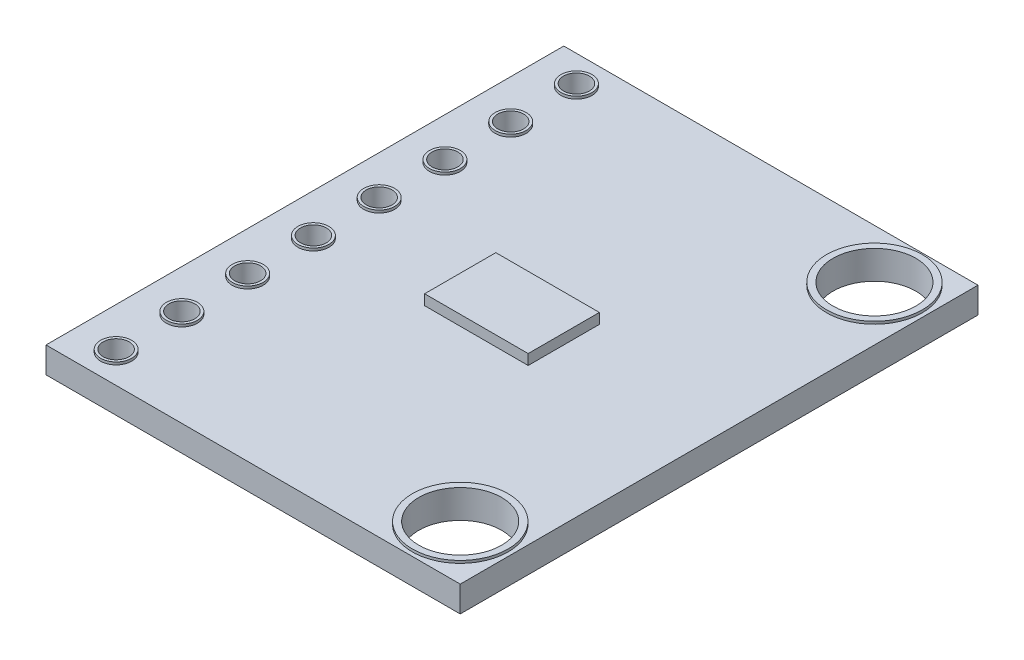
ISO-10303-21;
HEADER;
FILE_DESCRIPTION(('STEP AP214'),'2;1');
FILE_NAME('part.step','',(''),(''),'','','');
FILE_SCHEMA(('AUTOMOTIVE_DESIGN { 1 0 10303 214 1 1 1 1 }'));
ENDSEC;
DATA;
#1=APPLICATION_CONTEXT('core data for automotive mechanical design processes');
#2=APPLICATION_PROTOCOL_DEFINITION('international standard','automotive_design',2000,#1);
#3=PRODUCT_CONTEXT('',#1,'mechanical');
#4=PRODUCT('Part','Part','',(#3));
#5=PRODUCT_RELATED_PRODUCT_CATEGORY('part','',(#4));
#6=PRODUCT_DEFINITION_FORMATION('','',#4);
#7=PRODUCT_DEFINITION_CONTEXT('part definition',#1,'design');
#8=PRODUCT_DEFINITION('design','',#6,#7);
#9=PRODUCT_DEFINITION_SHAPE('','',#8);
#10=(LENGTH_UNIT() NAMED_UNIT(*) SI_UNIT(.MILLI.,.METRE.));
#11=(NAMED_UNIT(*) PLANE_ANGLE_UNIT() SI_UNIT($,.RADIAN.));
#12=(NAMED_UNIT(*) SI_UNIT($,.STERADIAN.) SOLID_ANGLE_UNIT());
#13=UNCERTAINTY_MEASURE_WITH_UNIT(LENGTH_MEASURE(1.E-05),#10,'distance_accuracy_value','');
#14=(GEOMETRIC_REPRESENTATION_CONTEXT(3) GLOBAL_UNCERTAINTY_ASSIGNED_CONTEXT((#13)) GLOBAL_UNIT_ASSIGNED_CONTEXT((#10,
#11,#12)) REPRESENTATION_CONTEXT('',''));
#15=CARTESIAN_POINT('',(0.,0.,0.));
#16=DIRECTION('',(0.,0.,1.));
#17=DIRECTION('',(1.,0.,0.));
#18=AXIS2_PLACEMENT_3D('',#15,#16,#17);
#19=CARTESIAN_POINT('',(2.,1.4,1.375));
#20=DIRECTION('',(-1.,0.,0.));
#21=DIRECTION('',(0.,0.,1.));
#22=AXIS2_PLACEMENT_3D('',#19,#20,#21);
#23=PLANE('',#22);
#24=DIRECTION('',(0.,0.,-1.));
#25=VECTOR('',#24,1.);
#26=CARTESIAN_POINT('',(2.,1.,1.375));
#27=LINE('',#26,#25);
#28=CARTESIAN_POINT('',(2.,1.,1.375));
#29=VERTEX_POINT('',#28);
#30=CARTESIAN_POINT('',(2.,1.,-1.375));
#31=VERTEX_POINT('',#30);
#32=EDGE_CURVE('E107',#29,#31,#27,.T.);
#33=ORIENTED_EDGE('',*,*,#32,.T.);
#34=DIRECTION('',(0.,-1.,0.));
#35=VECTOR('',#34,1.);
#36=CARTESIAN_POINT('',(2.,1.4,-1.375));
#37=LINE('',#36,#35);
#38=CARTESIAN_POINT('',(2.,1.4,-1.375));
#39=VERTEX_POINT('',#38);
#40=EDGE_CURVE('E12',#39,#31,#37,.T.);
#41=ORIENTED_EDGE('',*,*,#40,.F.);
#42=DIRECTION('',(0.,0.,-1.));
#43=VECTOR('',#42,1.);
#44=CARTESIAN_POINT('',(2.,1.4,1.375));
#45=LINE('',#44,#43);
#46=CARTESIAN_POINT('',(2.,1.4,1.375));
#47=VERTEX_POINT('',#46);
#48=EDGE_CURVE('E95',#47,#39,#45,.T.);
#49=ORIENTED_EDGE('',*,*,#48,.F.);
#50=DIRECTION('',(0.,-1.,0.));
#51=VECTOR('',#50,1.);
#52=CARTESIAN_POINT('',(2.,1.4,1.375));
#53=LINE('',#52,#51);
#54=EDGE_CURVE('E103',#47,#29,#53,.T.);
#55=ORIENTED_EDGE('',*,*,#54,.T.);
#56=EDGE_LOOP('',(#33,#41,#49,#55));
#57=FACE_BOUND('',#56,.T.);
#58=ADVANCED_FACE('F44',(#57),#23,.F.);
#59=CARTESIAN_POINT('',(-2.,1.4,-1.375));
#60=DIRECTION('',(0.,0.,1.));
#61=DIRECTION('',(1.,0.,0.));
#62=AXIS2_PLACEMENT_3D('',#59,#60,#61);
#63=PLANE('',#62);
#64=DIRECTION('',(-1.,0.,0.));
#65=VECTOR('',#64,1.);
#66=CARTESIAN_POINT('',(-2.,1.,-1.375));
#67=LINE('',#66,#65);
#68=CARTESIAN_POINT('',(-2.,1.,-1.375));
#69=VERTEX_POINT('',#68);
#70=EDGE_CURVE('E99',#31,#69,#67,.T.);
#71=ORIENTED_EDGE('',*,*,#70,.T.);
#72=DIRECTION('',(0.,-1.,0.));
#73=VECTOR('',#72,1.);
#74=CARTESIAN_POINT('',(-2.,1.4,-1.375));
#75=LINE('',#74,#73);
#76=CARTESIAN_POINT('',(-2.,1.4,-1.375));
#77=VERTEX_POINT('',#76);
#78=EDGE_CURVE('E52',#77,#69,#75,.T.);
#79=ORIENTED_EDGE('',*,*,#78,.F.);
#80=DIRECTION('',(-1.,0.,0.));
#81=VECTOR('',#80,1.);
#82=CARTESIAN_POINT('',(-2.,1.4,-1.375));
#83=LINE('',#82,#81);
#84=EDGE_CURVE('E90',#39,#77,#83,.T.);
#85=ORIENTED_EDGE('',*,*,#84,.F.);
#86=ORIENTED_EDGE('',*,*,#40,.T.);
#87=EDGE_LOOP('',(#71,#79,#85,#86));
#88=FACE_BOUND('',#87,.T.);
#89=ADVANCED_FACE('F98',(#88),#63,.F.);
#90=CARTESIAN_POINT('',(-2.,1.4,1.375));
#91=DIRECTION('',(1.,0.,0.));
#92=DIRECTION('',(0.,0.,-1.));
#93=AXIS2_PLACEMENT_3D('',#90,#91,#92);
#94=PLANE('',#93);
#95=DIRECTION('',(0.,0.,1.));
#96=VECTOR('',#95,1.);
#97=CARTESIAN_POINT('',(-2.,1.,1.375));
#98=LINE('',#97,#96);
#99=CARTESIAN_POINT('',(-2.,1.,1.375));
#100=VERTEX_POINT('',#99);
#101=EDGE_CURVE('E77',#69,#100,#98,.T.);
#102=ORIENTED_EDGE('',*,*,#101,.T.);
#103=DIRECTION('',(0.,-1.,0.));
#104=VECTOR('',#103,1.);
#105=CARTESIAN_POINT('',(-2.,1.4,1.375));
#106=LINE('',#105,#104);
#107=CARTESIAN_POINT('',(-2.,1.4,1.375));
#108=VERTEX_POINT('',#107);
#109=EDGE_CURVE('E100',#108,#100,#106,.T.);
#110=ORIENTED_EDGE('',*,*,#109,.F.);
#111=DIRECTION('',(0.,0.,1.));
#112=VECTOR('',#111,1.);
#113=CARTESIAN_POINT('',(-2.,1.4,1.375));
#114=LINE('',#113,#112);
#115=EDGE_CURVE('E93',#77,#108,#114,.T.);
#116=ORIENTED_EDGE('',*,*,#115,.F.);
#117=ORIENTED_EDGE('',*,*,#78,.T.);
#118=EDGE_LOOP('',(#102,#110,#116,#117));
#119=FACE_BOUND('',#118,.T.);
#120=ADVANCED_FACE('F101',(#119),#94,.F.);
#121=CARTESIAN_POINT('',(-2.,1.4,1.375));
#122=DIRECTION('',(0.,0.,-1.));
#123=DIRECTION('',(-1.,0.,0.));
#124=AXIS2_PLACEMENT_3D('',#121,#122,#123);
#125=PLANE('',#124);
#126=DIRECTION('',(1.,0.,0.));
#127=VECTOR('',#126,1.);
#128=CARTESIAN_POINT('',(-2.,1.,1.375));
#129=LINE('',#128,#127);
#130=EDGE_CURVE('E83',#100,#29,#129,.T.);
#131=ORIENTED_EDGE('',*,*,#130,.T.);
#132=ORIENTED_EDGE('',*,*,#54,.F.);
#133=DIRECTION('',(1.,0.,0.));
#134=VECTOR('',#133,1.);
#135=CARTESIAN_POINT('',(-2.,1.4,1.375));
#136=LINE('',#135,#134);
#137=EDGE_CURVE('E60',#108,#47,#136,.T.);
#138=ORIENTED_EDGE('',*,*,#137,.F.);
#139=ORIENTED_EDGE('',*,*,#109,.T.);
#140=EDGE_LOOP('',(#131,#132,#138,#139));
#141=FACE_BOUND('',#140,.T.);
#142=ADVANCED_FACE('F114',(#141),#125,.F.);
#143=CARTESIAN_POINT('',(0.,1.4,0.));
#144=DIRECTION('',(0.,-1.,0.));
#145=DIRECTION('',(0.,0.,-1.));
#146=AXIS2_PLACEMENT_3D('',#143,#144,#145);
#147=PLANE('',#146);
#148=ORIENTED_EDGE('',*,*,#48,.T.);
#149=ORIENTED_EDGE('',*,*,#84,.T.);
#150=ORIENTED_EDGE('',*,*,#115,.T.);
#151=ORIENTED_EDGE('',*,*,#137,.T.);
#152=EDGE_LOOP('',(#148,#149,#150,#151));
#153=FACE_BOUND('',#152,.T.);
#154=ADVANCED_FACE('F91',(#153),#147,.F.);
#155=CARTESIAN_POINT('',(0.,1.,0.));
#156=DIRECTION('',(0.,-1.,0.));
#157=DIRECTION('',(0.,0.,-1.));
#158=AXIS2_PLACEMENT_3D('',#155,#156,#157);
#159=PLANE('',#158);
#160=ORIENTED_EDGE('',*,*,#32,.F.);
#161=ORIENTED_EDGE('',*,*,#130,.F.);
#162=ORIENTED_EDGE('',*,*,#101,.F.);
#163=ORIENTED_EDGE('',*,*,#70,.F.);
#164=EDGE_LOOP('',(#160,#161,#162,#163));
#165=FACE_BOUND('',#164,.T.);
#166=ADVANCED_FACE('F117',(#165),#159,.T.);
#167=CLOSED_SHELL('',(#58,#89,#120,#142,#154,#166));
#168=MANIFOLD_SOLID_BREP('B2',#167);
#169=CARTESIAN_POINT('',(8.,1.,10.));
#170=DIRECTION('',(-1.,0.,0.));
#171=DIRECTION('',(0.,0.,1.));
#172=AXIS2_PLACEMENT_3D('',#169,#170,#171);
#173=PLANE('',#172);
#174=DIRECTION('',(0.,0.,-1.));
#175=VECTOR('',#174,1.);
#176=CARTESIAN_POINT('',(8.,0.,10.));
#177=LINE('',#176,#175);
#178=CARTESIAN_POINT('',(8.,0.,10.));
#179=VERTEX_POINT('',#178);
#180=CARTESIAN_POINT('',(8.,0.,-10.));
#181=VERTEX_POINT('',#180);
#182=EDGE_CURVE('E236',#179,#181,#177,.T.);
#183=ORIENTED_EDGE('',*,*,#182,.T.);
#184=DIRECTION('',(0.,-1.,0.));
#185=VECTOR('',#184,1.);
#186=CARTESIAN_POINT('',(8.,1.,-10.));
#187=LINE('',#186,#185);
#188=CARTESIAN_POINT('',(8.,1.,-10.));
#189=VERTEX_POINT('',#188);
#190=EDGE_CURVE('E227',#189,#181,#187,.T.);
#191=ORIENTED_EDGE('',*,*,#190,.F.);
#192=DIRECTION('',(0.,0.,-1.));
#193=VECTOR('',#192,1.);
#194=CARTESIAN_POINT('',(8.,1.,10.));
#195=LINE('',#194,#193);
#196=CARTESIAN_POINT('',(8.,1.,10.));
#197=VERTEX_POINT('',#196);
#198=EDGE_CURVE('E221',#197,#189,#195,.T.);
#199=ORIENTED_EDGE('',*,*,#198,.F.);
#200=DIRECTION('',(0.,-1.,0.));
#201=VECTOR('',#200,1.);
#202=CARTESIAN_POINT('',(8.,1.,10.));
#203=LINE('',#202,#201);
#204=EDGE_CURVE('E232',#197,#179,#203,.T.);
#205=ORIENTED_EDGE('',*,*,#204,.T.);
#206=EDGE_LOOP('',(#183,#191,#199,#205));
#207=FACE_BOUND('',#206,.T.);
#208=ADVANCED_FACE('F167',(#207),#173,.F.);
#209=CARTESIAN_POINT('',(-8.,1.,-10.));
#210=DIRECTION('',(0.,0.,1.));
#211=DIRECTION('',(1.,0.,0.));
#212=AXIS2_PLACEMENT_3D('',#209,#210,#211);
#213=PLANE('',#212);
#214=DIRECTION('',(-1.,0.,0.));
#215=VECTOR('',#214,1.);
#216=CARTESIAN_POINT('',(-8.,0.,-10.));
#217=LINE('',#216,#215);
#218=CARTESIAN_POINT('',(-8.,0.,-10.));
#219=VERTEX_POINT('',#218);
#220=EDGE_CURVE('E226',#181,#219,#217,.T.);
#221=ORIENTED_EDGE('',*,*,#220,.T.);
#222=DIRECTION('',(0.,-1.,0.));
#223=VECTOR('',#222,1.);
#224=CARTESIAN_POINT('',(-8.,1.,-10.));
#225=LINE('',#224,#223);
#226=CARTESIAN_POINT('',(-8.,1.,-10.));
#227=VERTEX_POINT('',#226);
#228=EDGE_CURVE('E224',#227,#219,#225,.T.);
#229=ORIENTED_EDGE('',*,*,#228,.F.);
#230=DIRECTION('',(-1.,0.,0.));
#231=VECTOR('',#230,1.);
#232=CARTESIAN_POINT('',(-8.,1.,-10.));
#233=LINE('',#232,#231);
#234=EDGE_CURVE('E216',#189,#227,#233,.T.);
#235=ORIENTED_EDGE('',*,*,#234,.F.);
#236=ORIENTED_EDGE('',*,*,#190,.T.);
#237=EDGE_LOOP('',(#221,#229,#235,#236));
#238=FACE_BOUND('',#237,.T.);
#239=ADVANCED_FACE('F225',(#238),#213,.F.);
#240=CARTESIAN_POINT('',(-8.,1.,10.));
#241=DIRECTION('',(1.,0.,0.));
#242=DIRECTION('',(0.,0.,-1.));
#243=AXIS2_PLACEMENT_3D('',#240,#241,#242);
#244=PLANE('',#243);
#245=DIRECTION('',(0.,0.,1.));
#246=VECTOR('',#245,1.);
#247=CARTESIAN_POINT('',(-8.,0.,10.));
#248=LINE('',#247,#246);
#249=CARTESIAN_POINT('',(-8.,0.,10.));
#250=VERTEX_POINT('',#249);
#251=EDGE_CURVE('E202',#219,#250,#248,.T.);
#252=ORIENTED_EDGE('',*,*,#251,.T.);
#253=DIRECTION('',(0.,-1.,0.));
#254=VECTOR('',#253,1.);
#255=CARTESIAN_POINT('',(-8.,1.,10.));
#256=LINE('',#255,#254);
#257=CARTESIAN_POINT('',(-8.,1.,10.));
#258=VERTEX_POINT('',#257);
#259=EDGE_CURVE('E228',#258,#250,#256,.T.);
#260=ORIENTED_EDGE('',*,*,#259,.F.);
#261=DIRECTION('',(0.,0.,1.));
#262=VECTOR('',#261,1.);
#263=CARTESIAN_POINT('',(-8.,1.,10.));
#264=LINE('',#263,#262);
#265=EDGE_CURVE('E219',#227,#258,#264,.T.);
#266=ORIENTED_EDGE('',*,*,#265,.F.);
#267=ORIENTED_EDGE('',*,*,#228,.T.);
#268=EDGE_LOOP('',(#252,#260,#266,#267));
#269=FACE_BOUND('',#268,.T.);
#270=ADVANCED_FACE('F230',(#269),#244,.F.);
#271=CARTESIAN_POINT('',(-8.,1.,10.));
#272=DIRECTION('',(0.,0.,-1.));
#273=DIRECTION('',(-1.,0.,0.));
#274=AXIS2_PLACEMENT_3D('',#271,#272,#273);
#275=PLANE('',#274);
#276=DIRECTION('',(1.,0.,0.));
#277=VECTOR('',#276,1.);
#278=CARTESIAN_POINT('',(-8.,0.,10.));
#279=LINE('',#278,#277);
#280=EDGE_CURVE('E208',#250,#179,#279,.T.);
#281=ORIENTED_EDGE('',*,*,#280,.T.);
#282=ORIENTED_EDGE('',*,*,#204,.F.);
#283=DIRECTION('',(1.,0.,0.));
#284=VECTOR('',#283,1.);
#285=CARTESIAN_POINT('',(-8.,1.,10.));
#286=LINE('',#285,#284);
#287=EDGE_CURVE('E185',#258,#197,#286,.T.);
#288=ORIENTED_EDGE('',*,*,#287,.F.);
#289=ORIENTED_EDGE('',*,*,#259,.T.);
#290=EDGE_LOOP('',(#281,#282,#288,#289));
#291=FACE_BOUND('',#290,.T.);
#292=ADVANCED_FACE('F377',(#291),#275,.F.);
#293=CARTESIAN_POINT('',(0.,1.,0.));
#294=DIRECTION('',(0.,-1.,0.));
#295=DIRECTION('',(0.,0.,-1.));
#296=AXIS2_PLACEMENT_3D('',#293,#294,#295);
#297=PLANE('',#296);
#298=CARTESIAN_POINT('',(6.,1.,-8.));
#299=DIRECTION('',(0.,-1.,0.));
#300=DIRECTION('',(0.,0.,-1.));
#301=AXIS2_PLACEMENT_3D('',#298,#299,#300);
#302=CIRCLE('',#301,1.85);
#303=CARTESIAN_POINT('',(6.,1.,-9.85));
#304=VERTEX_POINT('',#303);
#305=EDGE_CURVE('E42',#304,#304,#302,.F.);
#306=ORIENTED_EDGE('',*,*,#305,.F.);
#307=EDGE_LOOP('',(#306));
#308=FACE_BOUND('',#307,.T.);
#309=CARTESIAN_POINT('',(6.,1.,8.));
#310=DIRECTION('',(0.,-1.,0.));
#311=DIRECTION('',(0.,0.,-1.));
#312=AXIS2_PLACEMENT_3D('',#309,#310,#311);
#313=CIRCLE('',#312,1.85);
#314=CARTESIAN_POINT('',(6.,1.,6.15));
#315=VERTEX_POINT('',#314);
#316=EDGE_CURVE('E176',#315,#315,#313,.F.);
#317=ORIENTED_EDGE('',*,*,#316,.F.);
#318=EDGE_LOOP('',(#317));
#319=FACE_BOUND('',#318,.T.);
#320=CARTESIAN_POINT('',(-6.40078584342518,1.,-8.89000000000001));
#321=DIRECTION('',(0.,-1.,0.));
#322=DIRECTION('',(0.,0.,-1.));
#323=AXIS2_PLACEMENT_3D('',#320,#321,#322);
#324=CIRCLE('',#323,0.6);
#325=CARTESIAN_POINT('',(-6.40078584342518,1.,-9.49000000000001));
#326=VERTEX_POINT('',#325);
#327=EDGE_CURVE('E267',#326,#326,#324,.F.);
#328=ORIENTED_EDGE('',*,*,#327,.F.);
#329=EDGE_LOOP('',(#328));
#330=FACE_BOUND('',#329,.T.);
#331=CARTESIAN_POINT('',(-6.40078584342518,1.,-6.35));
#332=DIRECTION('',(0.,-1.,0.));
#333=DIRECTION('',(0.,0.,-1.));
#334=AXIS2_PLACEMENT_3D('',#331,#332,#333);
#335=CIRCLE('',#334,0.6);
#336=CARTESIAN_POINT('',(-6.40078584342518,1.,-6.95));
#337=VERTEX_POINT('',#336);
#338=EDGE_CURVE('E264',#337,#337,#335,.F.);
#339=ORIENTED_EDGE('',*,*,#338,.F.);
#340=EDGE_LOOP('',(#339));
#341=FACE_BOUND('',#340,.T.);
#342=CARTESIAN_POINT('',(-6.40078584342518,1.,-3.81));
#343=DIRECTION('',(0.,-1.,0.));
#344=DIRECTION('',(0.,0.,-1.));
#345=AXIS2_PLACEMENT_3D('',#342,#343,#344);
#346=CIRCLE('',#345,0.6);
#347=CARTESIAN_POINT('',(-6.40078584342518,1.,-4.41));
#348=VERTEX_POINT('',#347);
#349=EDGE_CURVE('E261',#348,#348,#346,.F.);
#350=ORIENTED_EDGE('',*,*,#349,.F.);
#351=EDGE_LOOP('',(#350));
#352=FACE_BOUND('',#351,.T.);
#353=CARTESIAN_POINT('',(-6.40078584342518,1.,-1.27));
#354=DIRECTION('',(0.,-1.,0.));
#355=DIRECTION('',(0.,0.,-1.));
#356=AXIS2_PLACEMENT_3D('',#353,#354,#355);
#357=CIRCLE('',#356,0.6);
#358=CARTESIAN_POINT('',(-6.40078584342518,1.,-1.87));
#359=VERTEX_POINT('',#358);
#360=EDGE_CURVE('E258',#359,#359,#357,.F.);
#361=ORIENTED_EDGE('',*,*,#360,.F.);
#362=EDGE_LOOP('',(#361));
#363=FACE_BOUND('',#362,.T.);
#364=CARTESIAN_POINT('',(-6.40078584342518,1.,8.89));
#365=DIRECTION('',(0.,-1.,0.));
#366=DIRECTION('',(0.,0.,-1.));
#367=AXIS2_PLACEMENT_3D('',#364,#365,#366);
#368=CIRCLE('',#367,0.6);
#369=CARTESIAN_POINT('',(-6.40078584342518,1.,8.29));
#370=VERTEX_POINT('',#369);
#371=EDGE_CURVE('E255',#370,#370,#368,.F.);
#372=ORIENTED_EDGE('',*,*,#371,.F.);
#373=EDGE_LOOP('',(#372));
#374=FACE_BOUND('',#373,.T.);
#375=CARTESIAN_POINT('',(-6.40078584342518,1.,1.27));
#376=DIRECTION('',(0.,-1.,0.));
#377=DIRECTION('',(0.,0.,-1.));
#378=AXIS2_PLACEMENT_3D('',#375,#376,#377);
#379=CIRCLE('',#378,0.6);
#380=CARTESIAN_POINT('',(-6.40078584342518,1.,0.669999999999995));
#381=VERTEX_POINT('',#380);
#382=EDGE_CURVE('E252',#381,#381,#379,.F.);
#383=ORIENTED_EDGE('',*,*,#382,.F.);
#384=EDGE_LOOP('',(#383));
#385=FACE_BOUND('',#384,.T.);
#386=CARTESIAN_POINT('',(-6.40078584342518,1.,3.81));
#387=DIRECTION('',(0.,-1.,0.));
#388=DIRECTION('',(0.,0.,-1.));
#389=AXIS2_PLACEMENT_3D('',#386,#387,#388);
#390=CIRCLE('',#389,0.6);
#391=CARTESIAN_POINT('',(-6.40078584342518,1.,3.21));
#392=VERTEX_POINT('',#391);
#393=EDGE_CURVE('E249',#392,#392,#390,.F.);
#394=ORIENTED_EDGE('',*,*,#393,.F.);
#395=EDGE_LOOP('',(#394));
#396=FACE_BOUND('',#395,.T.);
#397=CARTESIAN_POINT('',(-6.40078584342518,1.,6.35));
#398=DIRECTION('',(0.,-1.,0.));
#399=DIRECTION('',(0.,0.,-1.));
#400=AXIS2_PLACEMENT_3D('',#397,#398,#399);
#401=CIRCLE('',#400,0.6);
#402=CARTESIAN_POINT('',(-6.40078584342518,1.,5.75));
#403=VERTEX_POINT('',#402);
#404=EDGE_CURVE('E246',#403,#403,#401,.F.);
#405=ORIENTED_EDGE('',*,*,#404,.F.);
#406=EDGE_LOOP('',(#405));
#407=FACE_BOUND('',#406,.T.);
#408=ORIENTED_EDGE('',*,*,#198,.T.);
#409=ORIENTED_EDGE('',*,*,#234,.T.);
#410=ORIENTED_EDGE('',*,*,#265,.T.);
#411=ORIENTED_EDGE('',*,*,#287,.T.);
#412=EDGE_LOOP('',(#408,#409,#410,#411));
#413=FACE_BOUND('',#412,.T.);
#414=ADVANCED_FACE('F217',(#308,#319,#330,#341,#352,#363,#374,#385,#396,#407,#413),#297,.F.);
#415=CARTESIAN_POINT('',(0.,0.,0.));
#416=DIRECTION('',(0.,-1.,0.));
#417=DIRECTION('',(0.,0.,-1.));
#418=AXIS2_PLACEMENT_3D('',#415,#416,#417);
#419=PLANE('',#418);
#420=CARTESIAN_POINT('',(6.,0.,-8.));
#421=DIRECTION('',(0.,-1.,0.));
#422=DIRECTION('',(0.,0.,-1.));
#423=AXIS2_PLACEMENT_3D('',#420,#421,#422);
#424=CIRCLE('',#423,1.6);
#425=CARTESIAN_POINT('',(6.,0.,-9.6));
#426=VERTEX_POINT('',#425);
#427=EDGE_CURVE('E170',#426,#426,#424,.T.);
#428=ORIENTED_EDGE('',*,*,#427,.F.);
#429=EDGE_LOOP('',(#428));
#430=FACE_BOUND('',#429,.T.);
#431=CARTESIAN_POINT('',(6.,0.,8.));
#432=DIRECTION('',(0.,-1.,0.));
#433=DIRECTION('',(0.,0.,-1.));
#434=AXIS2_PLACEMENT_3D('',#431,#432,#433);
#435=CIRCLE('',#434,1.6);
#436=CARTESIAN_POINT('',(6.,0.,6.4));
#437=VERTEX_POINT('',#436);
#438=EDGE_CURVE('E297',#437,#437,#435,.T.);
#439=ORIENTED_EDGE('',*,*,#438,.F.);
#440=EDGE_LOOP('',(#439));
#441=FACE_BOUND('',#440,.T.);
#442=CARTESIAN_POINT('',(-6.40078584342518,0.,8.89));
#443=DIRECTION('',(0.,-1.,0.));
#444=DIRECTION('',(0.,0.,-1.));
#445=AXIS2_PLACEMENT_3D('',#442,#443,#444);
#446=CIRCLE('',#445,0.500000000000001);
#447=CARTESIAN_POINT('',(-6.40078584342518,0.,8.39));
#448=VERTEX_POINT('',#447);
#449=EDGE_CURVE('E292',#448,#448,#446,.T.);
#450=ORIENTED_EDGE('',*,*,#449,.F.);
#451=EDGE_LOOP('',(#450));
#452=FACE_BOUND('',#451,.T.);
#453=CARTESIAN_POINT('',(-6.40078584342518,0.,6.35));
#454=DIRECTION('',(0.,-1.,0.));
#455=DIRECTION('',(0.,0.,-1.));
#456=AXIS2_PLACEMENT_3D('',#453,#454,#455);
#457=CIRCLE('',#456,0.5);
#458=CARTESIAN_POINT('',(-6.40078584342518,0.,5.85));
#459=VERTEX_POINT('',#458);
#460=EDGE_CURVE('E289',#459,#459,#457,.T.);
#461=ORIENTED_EDGE('',*,*,#460,.F.);
#462=EDGE_LOOP('',(#461));
#463=FACE_BOUND('',#462,.T.);
#464=CARTESIAN_POINT('',(-6.40078584342518,0.,3.81));
#465=DIRECTION('',(0.,-1.,0.));
#466=DIRECTION('',(0.,0.,-1.));
#467=AXIS2_PLACEMENT_3D('',#464,#465,#466);
#468=CIRCLE('',#467,0.500000000000002);
#469=CARTESIAN_POINT('',(-6.40078584342518,0.,3.30999999999999));
#470=VERTEX_POINT('',#469);
#471=EDGE_CURVE('E286',#470,#470,#468,.T.);
#472=ORIENTED_EDGE('',*,*,#471,.F.);
#473=EDGE_LOOP('',(#472));
#474=FACE_BOUND('',#473,.T.);
#475=CARTESIAN_POINT('',(-6.40078584342518,0.,1.27));
#476=DIRECTION('',(0.,-1.,0.));
#477=DIRECTION('',(0.,0.,-1.));
#478=AXIS2_PLACEMENT_3D('',#475,#476,#477);
#479=CIRCLE('',#478,0.500000000000002);
#480=CARTESIAN_POINT('',(-6.40078584342518,0.,0.769999999999994));
#481=VERTEX_POINT('',#480);
#482=EDGE_CURVE('E283',#481,#481,#479,.T.);
#483=ORIENTED_EDGE('',*,*,#482,.F.);
#484=EDGE_LOOP('',(#483));
#485=FACE_BOUND('',#484,.T.);
#486=CARTESIAN_POINT('',(-6.40078584342518,0.,-1.27));
#487=DIRECTION('',(0.,-1.,0.));
#488=DIRECTION('',(0.,0.,-1.));
#489=AXIS2_PLACEMENT_3D('',#486,#487,#488);
#490=CIRCLE('',#489,0.500000000000002);
#491=CARTESIAN_POINT('',(-6.40078584342518,0.,-1.77000000000001));
#492=VERTEX_POINT('',#491);
#493=EDGE_CURVE('E280',#492,#492,#490,.T.);
#494=ORIENTED_EDGE('',*,*,#493,.F.);
#495=EDGE_LOOP('',(#494));
#496=FACE_BOUND('',#495,.T.);
#497=CARTESIAN_POINT('',(-6.40078584342518,0.,-3.81));
#498=DIRECTION('',(0.,-1.,0.));
#499=DIRECTION('',(0.,0.,-1.));
#500=AXIS2_PLACEMENT_3D('',#497,#498,#499);
#501=CIRCLE('',#500,0.500000000000002);
#502=CARTESIAN_POINT('',(-6.40078584342518,0.,-4.31));
#503=VERTEX_POINT('',#502);
#504=EDGE_CURVE('E277',#503,#503,#501,.T.);
#505=ORIENTED_EDGE('',*,*,#504,.F.);
#506=EDGE_LOOP('',(#505));
#507=FACE_BOUND('',#506,.T.);
#508=CARTESIAN_POINT('',(-6.40078584342518,0.,-6.35));
#509=DIRECTION('',(0.,-1.,0.));
#510=DIRECTION('',(0.,0.,-1.));
#511=AXIS2_PLACEMENT_3D('',#508,#509,#510);
#512=CIRCLE('',#511,0.500000000000002);
#513=CARTESIAN_POINT('',(-6.40078584342518,0.,-6.85000000000001));
#514=VERTEX_POINT('',#513);
#515=EDGE_CURVE('E273',#514,#514,#512,.T.);
#516=ORIENTED_EDGE('',*,*,#515,.F.);
#517=EDGE_LOOP('',(#516));
#518=FACE_BOUND('',#517,.T.);
#519=CARTESIAN_POINT('',(-6.40078584342518,0.,-8.89000000000001));
#520=DIRECTION('',(0.,-1.,0.));
#521=DIRECTION('',(0.,0.,-1.));
#522=AXIS2_PLACEMENT_3D('',#519,#520,#521);
#523=CIRCLE('',#522,0.500000000000003);
#524=CARTESIAN_POINT('',(-6.40078584342518,0.,-9.39000000000001));
#525=VERTEX_POINT('',#524);
#526=EDGE_CURVE('E270',#525,#525,#523,.T.);
#527=ORIENTED_EDGE('',*,*,#526,.F.);
#528=EDGE_LOOP('',(#527));
#529=FACE_BOUND('',#528,.T.);
#530=ORIENTED_EDGE('',*,*,#182,.F.);
#531=ORIENTED_EDGE('',*,*,#280,.F.);
#532=ORIENTED_EDGE('',*,*,#251,.F.);
#533=ORIENTED_EDGE('',*,*,#220,.F.);
#534=EDGE_LOOP('',(#530,#531,#532,#533));
#535=FACE_BOUND('',#534,.T.);
#536=ADVANCED_FACE('F376',(#430,#441,#452,#463,#474,#485,#496,#507,#518,#529,#535),#419,.T.);
#537=CARTESIAN_POINT('',(-6.40078584342518,1.1,6.35));
#538=DIRECTION('',(0.,1.,0.));
#539=DIRECTION('',(0.,0.,1.));
#540=AXIS2_PLACEMENT_3D('',#537,#538,#539);
#541=PLANE('',#540);
#542=CARTESIAN_POINT('',(-6.40078584342518,1.1,6.35));
#543=DIRECTION('',(0.,1.,0.));
#544=DIRECTION('',(0.,0.,1.));
#545=AXIS2_PLACEMENT_3D('',#542,#543,#544);
#546=CIRCLE('',#545,0.6);
#547=CARTESIAN_POINT('',(-6.40078584342518,1.1,6.95));
#548=VERTEX_POINT('',#547);
#549=EDGE_CURVE('E239',#548,#548,#546,.T.);
#550=ORIENTED_EDGE('',*,*,#549,.T.);
#551=EDGE_LOOP('',(#550));
#552=FACE_BOUND('',#551,.T.);
#553=CARTESIAN_POINT('',(-6.40078584342518,1.1,6.35));
#554=DIRECTION('',(0.,1.,0.));
#555=DIRECTION('',(0.,0.,1.));
#556=AXIS2_PLACEMENT_3D('',#553,#554,#555);
#557=CIRCLE('',#556,0.500000000000001);
#558=CARTESIAN_POINT('',(-6.40078584342518,1.1,6.85));
#559=VERTEX_POINT('',#558);
#560=EDGE_CURVE('E359',#559,#559,#557,.T.);
#561=ORIENTED_EDGE('',*,*,#560,.F.);
#562=EDGE_LOOP('',(#561));
#563=FACE_BOUND('',#562,.T.);
#564=ADVANCED_FACE('F365',(#552,#563),#541,.T.);
#565=CARTESIAN_POINT('',(-6.40078584342518,1.1,6.35));
#566=DIRECTION('',(0.,-1.,0.));
#567=DIRECTION('',(0.,0.,-1.));
#568=AXIS2_PLACEMENT_3D('',#565,#566,#567);
#569=CYLINDRICAL_SURFACE('',#568,0.6);
#570=ORIENTED_EDGE('',*,*,#549,.F.);
#571=EDGE_LOOP('',(#570));
#572=FACE_BOUND('',#571,.T.);
#573=ORIENTED_EDGE('',*,*,#404,.T.);
#574=EDGE_LOOP('',(#573));
#575=FACE_BOUND('',#574,.T.);
#576=ADVANCED_FACE('F368',(#572,#575),#569,.T.);
#577=CARTESIAN_POINT('',(-6.40078584342518,1.1,6.35));
#578=DIRECTION('',(0.,-1.,0.));
#579=DIRECTION('',(0.,0.,-1.));
#580=AXIS2_PLACEMENT_3D('',#577,#578,#579);
#581=CYLINDRICAL_SURFACE('',#580,0.500000000000001);
#582=ORIENTED_EDGE('',*,*,#560,.T.);
#583=EDGE_LOOP('',(#582));
#584=FACE_BOUND('',#583,.T.);
#585=ORIENTED_EDGE('',*,*,#460,.T.);
#586=EDGE_LOOP('',(#585));
#587=FACE_BOUND('',#586,.T.);
#588=ADVANCED_FACE('F371',(#584,#587),#581,.F.);
#589=CARTESIAN_POINT('',(-6.40078584342518,1.1,3.81));
#590=DIRECTION('',(0.,1.,0.));
#591=DIRECTION('',(0.,0.,1.));
#592=AXIS2_PLACEMENT_3D('',#589,#590,#591);
#593=PLANE('',#592);
#594=CARTESIAN_POINT('',(-6.40078584342518,1.1,3.81));
#595=DIRECTION('',(0.,1.,0.));
#596=DIRECTION('',(0.,0.,1.));
#597=AXIS2_PLACEMENT_3D('',#594,#595,#596);
#598=CIRCLE('',#597,0.6);
#599=CARTESIAN_POINT('',(-6.40078584342518,1.1,4.41));
#600=VERTEX_POINT('',#599);
#601=EDGE_CURVE('E356',#600,#600,#598,.T.);
#602=ORIENTED_EDGE('',*,*,#601,.T.);
#603=EDGE_LOOP('',(#602));
#604=FACE_BOUND('',#603,.T.);
#605=CARTESIAN_POINT('',(-6.40078584342518,1.1,3.81));
#606=DIRECTION('',(0.,1.,0.));
#607=DIRECTION('',(0.,0.,1.));
#608=AXIS2_PLACEMENT_3D('',#605,#606,#607);
#609=CIRCLE('',#608,0.500000000000002);
#610=CARTESIAN_POINT('',(-6.40078584342518,1.1,4.31));
#611=VERTEX_POINT('',#610);
#612=EDGE_CURVE('E353',#611,#611,#609,.T.);
#613=ORIENTED_EDGE('',*,*,#612,.F.);
#614=EDGE_LOOP('',(#613));
#615=FACE_BOUND('',#614,.T.);
#616=ADVANCED_FACE('F429',(#604,#615),#593,.T.);
#617=CARTESIAN_POINT('',(-6.40078584342518,1.1,3.81));
#618=DIRECTION('',(0.,-1.,0.));
#619=DIRECTION('',(0.,0.,-1.));
#620=AXIS2_PLACEMENT_3D('',#617,#618,#619);
#621=CYLINDRICAL_SURFACE('',#620,0.6);
#622=ORIENTED_EDGE('',*,*,#601,.F.);
#623=EDGE_LOOP('',(#622));
#624=FACE_BOUND('',#623,.T.);
#625=ORIENTED_EDGE('',*,*,#393,.T.);
#626=EDGE_LOOP('',(#625));
#627=FACE_BOUND('',#626,.T.);
#628=ADVANCED_FACE('F434',(#624,#627),#621,.T.);
#629=CARTESIAN_POINT('',(-6.40078584342518,1.1,3.81));
#630=DIRECTION('',(0.,-1.,0.));
#631=DIRECTION('',(0.,0.,-1.));
#632=AXIS2_PLACEMENT_3D('',#629,#630,#631);
#633=CYLINDRICAL_SURFACE('',#632,0.500000000000002);
#634=ORIENTED_EDGE('',*,*,#612,.T.);
#635=EDGE_LOOP('',(#634));
#636=FACE_BOUND('',#635,.T.);
#637=ORIENTED_EDGE('',*,*,#471,.T.);
#638=EDGE_LOOP('',(#637));
#639=FACE_BOUND('',#638,.T.);
#640=ADVANCED_FACE('F444',(#636,#639),#633,.F.);
#641=CARTESIAN_POINT('',(-6.40078584342518,1.1,1.27));
#642=DIRECTION('',(0.,1.,0.));
#643=DIRECTION('',(0.,0.,1.));
#644=AXIS2_PLACEMENT_3D('',#641,#642,#643);
#645=PLANE('',#644);
#646=CARTESIAN_POINT('',(-6.40078584342518,1.1,1.27));
#647=DIRECTION('',(0.,1.,0.));
#648=DIRECTION('',(0.,0.,1.));
#649=AXIS2_PLACEMENT_3D('',#646,#647,#648);
#650=CIRCLE('',#649,0.6);
#651=CARTESIAN_POINT('',(-6.40078584342518,1.1,1.87));
#652=VERTEX_POINT('',#651);
#653=EDGE_CURVE('E350',#652,#652,#650,.T.);
#654=ORIENTED_EDGE('',*,*,#653,.T.);
#655=EDGE_LOOP('',(#654));
#656=FACE_BOUND('',#655,.T.);
#657=CARTESIAN_POINT('',(-6.40078584342518,1.1,1.27));
#658=DIRECTION('',(0.,1.,0.));
#659=DIRECTION('',(0.,0.,1.));
#660=AXIS2_PLACEMENT_3D('',#657,#658,#659);
#661=CIRCLE('',#660,0.500000000000002);
#662=CARTESIAN_POINT('',(-6.40078584342518,1.1,1.77));
#663=VERTEX_POINT('',#662);
#664=EDGE_CURVE('E347',#663,#663,#661,.T.);
#665=ORIENTED_EDGE('',*,*,#664,.F.);
#666=EDGE_LOOP('',(#665));
#667=FACE_BOUND('',#666,.T.);
#668=ADVANCED_FACE('F452',(#656,#667),#645,.T.);
#669=CARTESIAN_POINT('',(-6.40078584342518,1.1,1.27));
#670=DIRECTION('',(0.,-1.,0.));
#671=DIRECTION('',(0.,0.,-1.));
#672=AXIS2_PLACEMENT_3D('',#669,#670,#671);
#673=CYLINDRICAL_SURFACE('',#672,0.6);
#674=ORIENTED_EDGE('',*,*,#653,.F.);
#675=EDGE_LOOP('',(#674));
#676=FACE_BOUND('',#675,.T.);
#677=ORIENTED_EDGE('',*,*,#382,.T.);
#678=EDGE_LOOP('',(#677));
#679=FACE_BOUND('',#678,.T.);
#680=ADVANCED_FACE('F457',(#676,#679),#673,.T.);
#681=CARTESIAN_POINT('',(-6.40078584342518,1.1,1.27));
#682=DIRECTION('',(0.,-1.,0.));
#683=DIRECTION('',(0.,0.,-1.));
#684=AXIS2_PLACEMENT_3D('',#681,#682,#683);
#685=CYLINDRICAL_SURFACE('',#684,0.500000000000002);
#686=ORIENTED_EDGE('',*,*,#664,.T.);
#687=EDGE_LOOP('',(#686));
#688=FACE_BOUND('',#687,.T.);
#689=ORIENTED_EDGE('',*,*,#482,.T.);
#690=EDGE_LOOP('',(#689));
#691=FACE_BOUND('',#690,.T.);
#692=ADVANCED_FACE('F467',(#688,#691),#685,.F.);
#693=CARTESIAN_POINT('',(-6.40078584342518,1.1,8.89));
#694=DIRECTION('',(0.,1.,0.));
#695=DIRECTION('',(0.,0.,1.));
#696=AXIS2_PLACEMENT_3D('',#693,#694,#695);
#697=PLANE('',#696);
#698=CARTESIAN_POINT('',(-6.40078584342518,1.1,8.89));
#699=DIRECTION('',(0.,1.,0.));
#700=DIRECTION('',(0.,0.,1.));
#701=AXIS2_PLACEMENT_3D('',#698,#699,#700);
#702=CIRCLE('',#701,0.6);
#703=CARTESIAN_POINT('',(-6.40078584342518,1.1,9.49));
#704=VERTEX_POINT('',#703);
#705=EDGE_CURVE('E344',#704,#704,#702,.T.);
#706=ORIENTED_EDGE('',*,*,#705,.T.);
#707=EDGE_LOOP('',(#706));
#708=FACE_BOUND('',#707,.T.);
#709=CARTESIAN_POINT('',(-6.40078584342518,1.1,8.89));
#710=DIRECTION('',(0.,1.,0.));
#711=DIRECTION('',(0.,0.,1.));
#712=AXIS2_PLACEMENT_3D('',#709,#710,#711);
#713=CIRCLE('',#712,0.500000000000001);
#714=CARTESIAN_POINT('',(-6.40078584342518,1.1,9.39));
#715=VERTEX_POINT('',#714);
#716=EDGE_CURVE('E341',#715,#715,#713,.T.);
#717=ORIENTED_EDGE('',*,*,#716,.F.);
#718=EDGE_LOOP('',(#717));
#719=FACE_BOUND('',#718,.T.);
#720=ADVANCED_FACE('F475',(#708,#719),#697,.T.);
#721=CARTESIAN_POINT('',(-6.40078584342518,1.1,8.89));
#722=DIRECTION('',(0.,-1.,0.));
#723=DIRECTION('',(0.,0.,-1.));
#724=AXIS2_PLACEMENT_3D('',#721,#722,#723);
#725=CYLINDRICAL_SURFACE('',#724,0.6);
#726=ORIENTED_EDGE('',*,*,#705,.F.);
#727=EDGE_LOOP('',(#726));
#728=FACE_BOUND('',#727,.T.);
#729=ORIENTED_EDGE('',*,*,#371,.T.);
#730=EDGE_LOOP('',(#729));
#731=FACE_BOUND('',#730,.T.);
#732=ADVANCED_FACE('F480',(#728,#731),#725,.T.);
#733=CARTESIAN_POINT('',(-6.40078584342518,1.1,8.89));
#734=DIRECTION('',(0.,-1.,0.));
#735=DIRECTION('',(0.,0.,-1.));
#736=AXIS2_PLACEMENT_3D('',#733,#734,#735);
#737=CYLINDRICAL_SURFACE('',#736,0.500000000000001);
#738=ORIENTED_EDGE('',*,*,#716,.T.);
#739=EDGE_LOOP('',(#738));
#740=FACE_BOUND('',#739,.T.);
#741=ORIENTED_EDGE('',*,*,#449,.T.);
#742=EDGE_LOOP('',(#741));
#743=FACE_BOUND('',#742,.T.);
#744=ADVANCED_FACE('F490',(#740,#743),#737,.F.);
#745=CARTESIAN_POINT('',(-6.40078584342518,1.1,-1.27));
#746=DIRECTION('',(0.,1.,0.));
#747=DIRECTION('',(0.,0.,1.));
#748=AXIS2_PLACEMENT_3D('',#745,#746,#747);
#749=PLANE('',#748);
#750=CARTESIAN_POINT('',(-6.40078584342518,1.1,-1.27));
#751=DIRECTION('',(0.,1.,0.));
#752=DIRECTION('',(0.,0.,1.));
#753=AXIS2_PLACEMENT_3D('',#750,#751,#752);
#754=CIRCLE('',#753,0.6);
#755=CARTESIAN_POINT('',(-6.40078584342518,1.1,-0.670000000000004));
#756=VERTEX_POINT('',#755);
#757=EDGE_CURVE('E338',#756,#756,#754,.T.);
#758=ORIENTED_EDGE('',*,*,#757,.T.);
#759=EDGE_LOOP('',(#758));
#760=FACE_BOUND('',#759,.T.);
#761=CARTESIAN_POINT('',(-6.40078584342518,1.1,-1.27));
#762=DIRECTION('',(0.,1.,0.));
#763=DIRECTION('',(0.,0.,1.));
#764=AXIS2_PLACEMENT_3D('',#761,#762,#763);
#765=CIRCLE('',#764,0.500000000000002);
#766=CARTESIAN_POINT('',(-6.40078584342518,1.1,-0.770000000000003));
#767=VERTEX_POINT('',#766);
#768=EDGE_CURVE('E335',#767,#767,#765,.T.);
#769=ORIENTED_EDGE('',*,*,#768,.F.);
#770=EDGE_LOOP('',(#769));
#771=FACE_BOUND('',#770,.T.);
#772=ADVANCED_FACE('F498',(#760,#771),#749,.T.);
#773=CARTESIAN_POINT('',(-6.40078584342518,1.1,-1.27));
#774=DIRECTION('',(0.,-1.,0.));
#775=DIRECTION('',(0.,0.,-1.));
#776=AXIS2_PLACEMENT_3D('',#773,#774,#775);
#777=CYLINDRICAL_SURFACE('',#776,0.6);
#778=ORIENTED_EDGE('',*,*,#757,.F.);
#779=EDGE_LOOP('',(#778));
#780=FACE_BOUND('',#779,.T.);
#781=ORIENTED_EDGE('',*,*,#360,.T.);
#782=EDGE_LOOP('',(#781));
#783=FACE_BOUND('',#782,.T.);
#784=ADVANCED_FACE('F503',(#780,#783),#777,.T.);
#785=CARTESIAN_POINT('',(-6.40078584342518,1.1,-1.27));
#786=DIRECTION('',(0.,-1.,0.));
#787=DIRECTION('',(0.,0.,-1.));
#788=AXIS2_PLACEMENT_3D('',#785,#786,#787);
#789=CYLINDRICAL_SURFACE('',#788,0.500000000000002);
#790=ORIENTED_EDGE('',*,*,#768,.T.);
#791=EDGE_LOOP('',(#790));
#792=FACE_BOUND('',#791,.T.);
#793=ORIENTED_EDGE('',*,*,#493,.T.);
#794=EDGE_LOOP('',(#793));
#795=FACE_BOUND('',#794,.T.);
#796=ADVANCED_FACE('F513',(#792,#795),#789,.F.);
#797=CARTESIAN_POINT('',(-6.40078584342518,1.1,-3.81));
#798=DIRECTION('',(0.,1.,0.));
#799=DIRECTION('',(0.,0.,1.));
#800=AXIS2_PLACEMENT_3D('',#797,#798,#799);
#801=PLANE('',#800);
#802=CARTESIAN_POINT('',(-6.40078584342518,1.1,-3.81));
#803=DIRECTION('',(0.,1.,0.));
#804=DIRECTION('',(0.,0.,1.));
#805=AXIS2_PLACEMENT_3D('',#802,#803,#804);
#806=CIRCLE('',#805,0.6);
#807=CARTESIAN_POINT('',(-6.40078584342518,1.1,-3.21));
#808=VERTEX_POINT('',#807);
#809=EDGE_CURVE('E332',#808,#808,#806,.T.);
#810=ORIENTED_EDGE('',*,*,#809,.T.);
#811=EDGE_LOOP('',(#810));
#812=FACE_BOUND('',#811,.T.);
#813=CARTESIAN_POINT('',(-6.40078584342518,1.1,-3.81));
#814=DIRECTION('',(0.,1.,0.));
#815=DIRECTION('',(0.,0.,1.));
#816=AXIS2_PLACEMENT_3D('',#813,#814,#815);
#817=CIRCLE('',#816,0.500000000000002);
#818=CARTESIAN_POINT('',(-6.40078584342518,1.1,-3.31));
#819=VERTEX_POINT('',#818);
#820=EDGE_CURVE('E329',#819,#819,#817,.T.);
#821=ORIENTED_EDGE('',*,*,#820,.F.);
#822=EDGE_LOOP('',(#821));
#823=FACE_BOUND('',#822,.T.);
#824=ADVANCED_FACE('F521',(#812,#823),#801,.T.);
#825=CARTESIAN_POINT('',(-6.40078584342518,1.1,-3.81));
#826=DIRECTION('',(0.,-1.,0.));
#827=DIRECTION('',(0.,0.,-1.));
#828=AXIS2_PLACEMENT_3D('',#825,#826,#827);
#829=CYLINDRICAL_SURFACE('',#828,0.6);
#830=ORIENTED_EDGE('',*,*,#809,.F.);
#831=EDGE_LOOP('',(#830));
#832=FACE_BOUND('',#831,.T.);
#833=ORIENTED_EDGE('',*,*,#349,.T.);
#834=EDGE_LOOP('',(#833));
#835=FACE_BOUND('',#834,.T.);
#836=ADVANCED_FACE('F526',(#832,#835),#829,.T.);
#837=CARTESIAN_POINT('',(-6.40078584342518,1.1,-3.81));
#838=DIRECTION('',(0.,-1.,0.));
#839=DIRECTION('',(0.,0.,-1.));
#840=AXIS2_PLACEMENT_3D('',#837,#838,#839);
#841=CYLINDRICAL_SURFACE('',#840,0.500000000000002);
#842=ORIENTED_EDGE('',*,*,#820,.T.);
#843=EDGE_LOOP('',(#842));
#844=FACE_BOUND('',#843,.T.);
#845=ORIENTED_EDGE('',*,*,#504,.T.);
#846=EDGE_LOOP('',(#845));
#847=FACE_BOUND('',#846,.T.);
#848=ADVANCED_FACE('F536',(#844,#847),#841,.F.);
#849=CARTESIAN_POINT('',(-6.40078584342518,1.1,-6.35));
#850=DIRECTION('',(0.,1.,0.));
#851=DIRECTION('',(0.,0.,1.));
#852=AXIS2_PLACEMENT_3D('',#849,#850,#851);
#853=PLANE('',#852);
#854=CARTESIAN_POINT('',(-6.40078584342518,1.1,-6.35));
#855=DIRECTION('',(0.,1.,0.));
#856=DIRECTION('',(0.,0.,1.));
#857=AXIS2_PLACEMENT_3D('',#854,#855,#856);
#858=CIRCLE('',#857,0.6);
#859=CARTESIAN_POINT('',(-6.40078584342518,1.1,-5.75000000000001));
#860=VERTEX_POINT('',#859);
#861=EDGE_CURVE('E326',#860,#860,#858,.T.);
#862=ORIENTED_EDGE('',*,*,#861,.T.);
#863=EDGE_LOOP('',(#862));
#864=FACE_BOUND('',#863,.T.);
#865=CARTESIAN_POINT('',(-6.40078584342518,1.1,-6.35));
#866=DIRECTION('',(0.,1.,0.));
#867=DIRECTION('',(0.,0.,1.));
#868=AXIS2_PLACEMENT_3D('',#865,#866,#867);
#869=CIRCLE('',#868,0.500000000000002);
#870=CARTESIAN_POINT('',(-6.40078584342518,1.1,-5.85));
#871=VERTEX_POINT('',#870);
#872=EDGE_CURVE('E323',#871,#871,#869,.T.);
#873=ORIENTED_EDGE('',*,*,#872,.F.);
#874=EDGE_LOOP('',(#873));
#875=FACE_BOUND('',#874,.T.);
#876=ADVANCED_FACE('F544',(#864,#875),#853,.T.);
#877=CARTESIAN_POINT('',(-6.40078584342518,1.1,-6.35));
#878=DIRECTION('',(0.,-1.,0.));
#879=DIRECTION('',(0.,0.,-1.));
#880=AXIS2_PLACEMENT_3D('',#877,#878,#879);
#881=CYLINDRICAL_SURFACE('',#880,0.6);
#882=ORIENTED_EDGE('',*,*,#861,.F.);
#883=EDGE_LOOP('',(#882));
#884=FACE_BOUND('',#883,.T.);
#885=ORIENTED_EDGE('',*,*,#338,.T.);
#886=EDGE_LOOP('',(#885));
#887=FACE_BOUND('',#886,.T.);
#888=ADVANCED_FACE('F549',(#884,#887),#881,.T.);
#889=CARTESIAN_POINT('',(-6.40078584342518,1.1,-6.35));
#890=DIRECTION('',(0.,-1.,0.));
#891=DIRECTION('',(0.,0.,-1.));
#892=AXIS2_PLACEMENT_3D('',#889,#890,#891);
#893=CYLINDRICAL_SURFACE('',#892,0.500000000000002);
#894=ORIENTED_EDGE('',*,*,#872,.T.);
#895=EDGE_LOOP('',(#894));
#896=FACE_BOUND('',#895,.T.);
#897=ORIENTED_EDGE('',*,*,#515,.T.);
#898=EDGE_LOOP('',(#897));
#899=FACE_BOUND('',#898,.T.);
#900=ADVANCED_FACE('F559',(#896,#899),#893,.F.);
#901=CARTESIAN_POINT('',(-6.40078584342518,1.1,-8.89000000000001));
#902=DIRECTION('',(0.,1.,0.));
#903=DIRECTION('',(0.,0.,1.));
#904=AXIS2_PLACEMENT_3D('',#901,#902,#903);
#905=PLANE('',#904);
#906=CARTESIAN_POINT('',(-6.40078584342518,1.1,-8.89000000000001));
#907=DIRECTION('',(0.,1.,0.));
#908=DIRECTION('',(0.,0.,1.));
#909=AXIS2_PLACEMENT_3D('',#906,#907,#908);
#910=CIRCLE('',#909,0.6);
#911=CARTESIAN_POINT('',(-6.40078584342518,1.1,-8.29000000000001));
#912=VERTEX_POINT('',#911);
#913=EDGE_CURVE('E320',#912,#912,#910,.T.);
#914=ORIENTED_EDGE('',*,*,#913,.T.);
#915=EDGE_LOOP('',(#914));
#916=FACE_BOUND('',#915,.T.);
#917=CARTESIAN_POINT('',(-6.40078584342518,1.1,-8.89000000000001));
#918=DIRECTION('',(0.,1.,0.));
#919=DIRECTION('',(0.,0.,1.));
#920=AXIS2_PLACEMENT_3D('',#917,#918,#919);
#921=CIRCLE('',#920,0.500000000000002);
#922=CARTESIAN_POINT('',(-6.40078584342518,1.1,-8.39));
#923=VERTEX_POINT('',#922);
#924=EDGE_CURVE('E295',#923,#923,#921,.T.);
#925=ORIENTED_EDGE('',*,*,#924,.F.);
#926=EDGE_LOOP('',(#925));
#927=FACE_BOUND('',#926,.T.);
#928=ADVANCED_FACE('F567',(#916,#927),#905,.T.);
#929=CARTESIAN_POINT('',(-6.40078584342518,1.1,-8.89000000000001));
#930=DIRECTION('',(0.,-1.,0.));
#931=DIRECTION('',(0.,0.,-1.));
#932=AXIS2_PLACEMENT_3D('',#929,#930,#931);
#933=CYLINDRICAL_SURFACE('',#932,0.6);
#934=ORIENTED_EDGE('',*,*,#913,.F.);
#935=EDGE_LOOP('',(#934));
#936=FACE_BOUND('',#935,.T.);
#937=ORIENTED_EDGE('',*,*,#327,.T.);
#938=EDGE_LOOP('',(#937));
#939=FACE_BOUND('',#938,.T.);
#940=ADVANCED_FACE('F572',(#936,#939),#933,.T.);
#941=CARTESIAN_POINT('',(-6.40078584342518,1.1,-8.89000000000001));
#942=DIRECTION('',(0.,-1.,0.));
#943=DIRECTION('',(0.,0.,-1.));
#944=AXIS2_PLACEMENT_3D('',#941,#942,#943);
#945=CYLINDRICAL_SURFACE('',#944,0.500000000000002);
#946=ORIENTED_EDGE('',*,*,#924,.T.);
#947=EDGE_LOOP('',(#946));
#948=FACE_BOUND('',#947,.T.);
#949=ORIENTED_EDGE('',*,*,#526,.T.);
#950=EDGE_LOOP('',(#949));
#951=FACE_BOUND('',#950,.T.);
#952=ADVANCED_FACE('F582',(#948,#951),#945,.F.);
#953=CARTESIAN_POINT('',(6.,1.1,8.));
#954=DIRECTION('',(0.,1.,0.));
#955=DIRECTION('',(0.,0.,1.));
#956=AXIS2_PLACEMENT_3D('',#953,#954,#955);
#957=PLANE('',#956);
#958=CARTESIAN_POINT('',(6.,1.1,8.));
#959=DIRECTION('',(0.,1.,0.));
#960=DIRECTION('',(0.,0.,1.));
#961=AXIS2_PLACEMENT_3D('',#958,#959,#960);
#962=CIRCLE('',#961,1.85);
#963=CARTESIAN_POINT('',(6.,1.1,9.85));
#964=VERTEX_POINT('',#963);
#965=EDGE_CURVE('E274',#964,#964,#962,.T.);
#966=ORIENTED_EDGE('',*,*,#965,.T.);
#967=EDGE_LOOP('',(#966));
#968=FACE_BOUND('',#967,.T.);
#969=CARTESIAN_POINT('',(6.,1.1,8.));
#970=DIRECTION('',(0.,1.,0.));
#971=DIRECTION('',(0.,0.,1.));
#972=AXIS2_PLACEMENT_3D('',#969,#970,#971);
#973=CIRCLE('',#972,1.6);
#974=CARTESIAN_POINT('',(6.,1.1,9.6));
#975=VERTEX_POINT('',#974);
#976=EDGE_CURVE('E311',#975,#975,#973,.T.);
#977=ORIENTED_EDGE('',*,*,#976,.F.);
#978=EDGE_LOOP('',(#977));
#979=FACE_BOUND('',#978,.T.);
#980=ADVANCED_FACE('F648',(#968,#979),#957,.T.);
#981=CARTESIAN_POINT('',(6.,1.1,8.));
#982=DIRECTION('',(0.,-1.,0.));
#983=DIRECTION('',(0.,0.,-1.));
#984=AXIS2_PLACEMENT_3D('',#981,#982,#983);
#985=CYLINDRICAL_SURFACE('',#984,1.85);
#986=ORIENTED_EDGE('',*,*,#965,.F.);
#987=EDGE_LOOP('',(#986));
#988=FACE_BOUND('',#987,.T.);
#989=ORIENTED_EDGE('',*,*,#316,.T.);
#990=EDGE_LOOP('',(#989));
#991=FACE_BOUND('',#990,.T.);
#992=ADVANCED_FACE('F662',(#988,#991),#985,.T.);
#993=CARTESIAN_POINT('',(6.,1.1,8.));
#994=DIRECTION('',(0.,-1.,0.));
#995=DIRECTION('',(0.,0.,-1.));
#996=AXIS2_PLACEMENT_3D('',#993,#994,#995);
#997=CYLINDRICAL_SURFACE('',#996,1.6);
#998=ORIENTED_EDGE('',*,*,#976,.T.);
#999=EDGE_LOOP('',(#998));
#1000=FACE_BOUND('',#999,.T.);
#1001=ORIENTED_EDGE('',*,*,#438,.T.);
#1002=EDGE_LOOP('',(#1001));
#1003=FACE_BOUND('',#1002,.T.);
#1004=ADVANCED_FACE('F672',(#1000,#1003),#997,.F.);
#1005=CARTESIAN_POINT('',(6.,1.1,-8.));
#1006=DIRECTION('',(0.,1.,0.));
#1007=DIRECTION('',(0.,0.,1.));
#1008=AXIS2_PLACEMENT_3D('',#1005,#1006,#1007);
#1009=PLANE('',#1008);
#1010=CARTESIAN_POINT('',(6.,1.1,-8.));
#1011=DIRECTION('',(0.,1.,0.));
#1012=DIRECTION('',(0.,0.,1.));
#1013=AXIS2_PLACEMENT_3D('',#1010,#1011,#1012);
#1014=CIRCLE('',#1013,1.85);
#1015=CARTESIAN_POINT('',(6.,1.1,-6.15));
#1016=VERTEX_POINT('',#1015);
#1017=EDGE_CURVE('E306',#1016,#1016,#1014,.T.);
#1018=ORIENTED_EDGE('',*,*,#1017,.T.);
#1019=EDGE_LOOP('',(#1018));
#1020=FACE_BOUND('',#1019,.T.);
#1021=CARTESIAN_POINT('',(6.,1.1,-8.));
#1022=DIRECTION('',(0.,1.,0.));
#1023=DIRECTION('',(0.,0.,1.));
#1024=AXIS2_PLACEMENT_3D('',#1021,#1022,#1023);
#1025=CIRCLE('',#1024,1.6);
#1026=CARTESIAN_POINT('',(6.,1.1,-6.4));
#1027=VERTEX_POINT('',#1026);
#1028=EDGE_CURVE('E302',#1027,#1027,#1025,.T.);
#1029=ORIENTED_EDGE('',*,*,#1028,.F.);
#1030=EDGE_LOOP('',(#1029));
#1031=FACE_BOUND('',#1030,.T.);
#1032=ADVANCED_FACE('F680',(#1020,#1031),#1009,.T.);
#1033=CARTESIAN_POINT('',(6.,1.1,-8.));
#1034=DIRECTION('',(0.,-1.,0.));
#1035=DIRECTION('',(0.,0.,-1.));
#1036=AXIS2_PLACEMENT_3D('',#1033,#1034,#1035);
#1037=CYLINDRICAL_SURFACE('',#1036,1.85);
#1038=ORIENTED_EDGE('',*,*,#1017,.F.);
#1039=EDGE_LOOP('',(#1038));
#1040=FACE_BOUND('',#1039,.T.);
#1041=ORIENTED_EDGE('',*,*,#305,.T.);
#1042=EDGE_LOOP('',(#1041));
#1043=FACE_BOUND('',#1042,.T.);
#1044=ADVANCED_FACE('F685',(#1040,#1043),#1037,.T.);
#1045=CARTESIAN_POINT('',(6.,1.1,-8.));
#1046=DIRECTION('',(0.,-1.,0.));
#1047=DIRECTION('',(0.,0.,-1.));
#1048=AXIS2_PLACEMENT_3D('',#1045,#1046,#1047);
#1049=CYLINDRICAL_SURFACE('',#1048,1.6);
#1050=ORIENTED_EDGE('',*,*,#1028,.T.);
#1051=EDGE_LOOP('',(#1050));
#1052=FACE_BOUND('',#1051,.T.);
#1053=ORIENTED_EDGE('',*,*,#427,.T.);
#1054=EDGE_LOOP('',(#1053));
#1055=FACE_BOUND('',#1054,.T.);
#1056=ADVANCED_FACE('F695',(#1052,#1055),#1049,.F.);
#1057=CLOSED_SHELL('',(#208,#239,#270,#292,#414,#536,#564,#576,#588,#616,#628,#640,#668,#680,
#692,#720,#732,#744,#772,#784,#796,#824,#836,#848,#876,#888,#900,#928,#940,#952,#980,#992,#1004,
#1032,#1044,#1056));
#1058=MANIFOLD_SOLID_BREP('B6',#1057);
#1059=ADVANCED_BREP_SHAPE_REPRESENTATION('',(#18,#168,#1058),#14);
#1060=SHAPE_DEFINITION_REPRESENTATION(#9,#1059);
ENDSEC;
END-ISO-10303-21;
